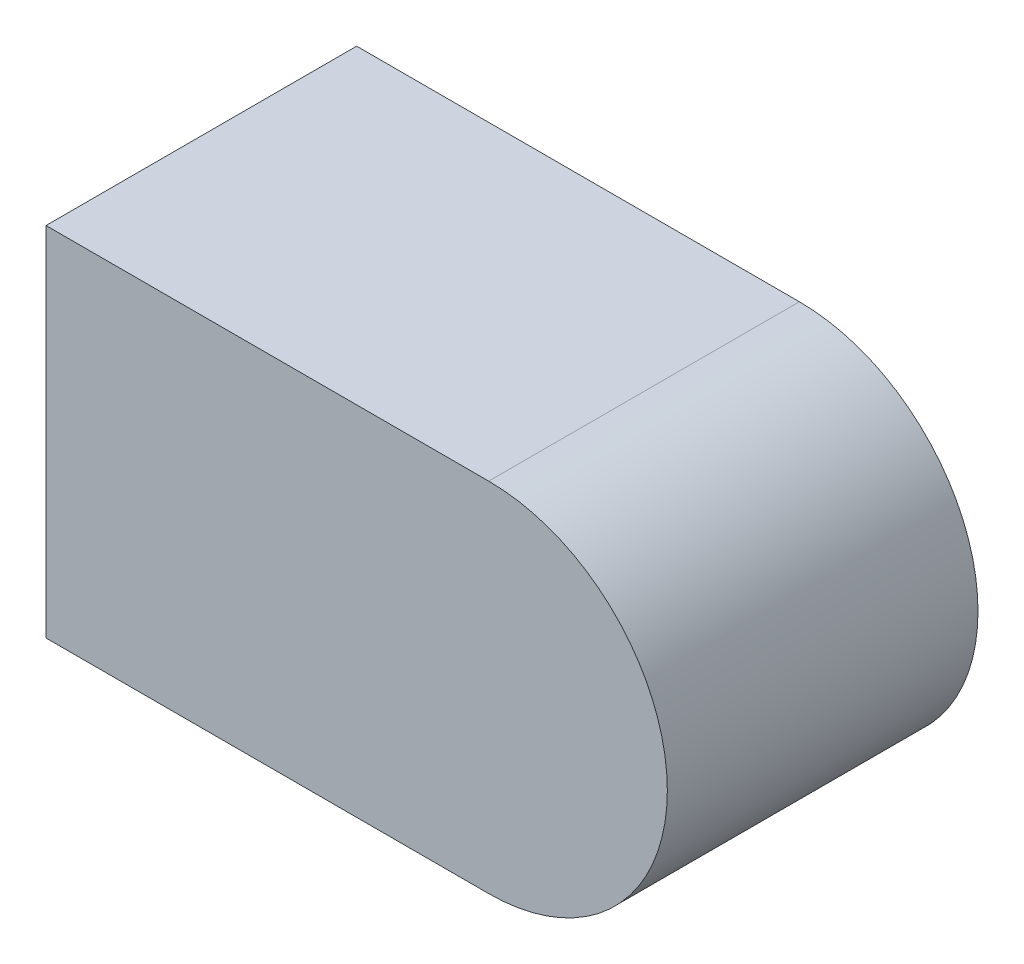
ISO-10303-21;
HEADER;
FILE_DESCRIPTION(('STEP AP214'),'2;1');
FILE_NAME('part.step','',(''),(''),'','','');
FILE_SCHEMA(('AUTOMOTIVE_DESIGN { 1 0 10303 214 1 1 1 1 }'));
ENDSEC;
DATA;
#1=APPLICATION_CONTEXT('core data for automotive mechanical design processes');
#2=APPLICATION_PROTOCOL_DEFINITION('international standard','automotive_design',2000,#1);
#3=PRODUCT_CONTEXT('',#1,'mechanical');
#4=PRODUCT('Part','Part','',(#3));
#5=PRODUCT_RELATED_PRODUCT_CATEGORY('part','',(#4));
#6=PRODUCT_DEFINITION_FORMATION('','',#4);
#7=PRODUCT_DEFINITION_CONTEXT('part definition',#1,'design');
#8=PRODUCT_DEFINITION('design','',#6,#7);
#9=PRODUCT_DEFINITION_SHAPE('','',#8);
#10=(LENGTH_UNIT() NAMED_UNIT(*) SI_UNIT(.MILLI.,.METRE.));
#11=(NAMED_UNIT(*) PLANE_ANGLE_UNIT() SI_UNIT($,.RADIAN.));
#12=(NAMED_UNIT(*) SI_UNIT($,.STERADIAN.) SOLID_ANGLE_UNIT());
#13=UNCERTAINTY_MEASURE_WITH_UNIT(LENGTH_MEASURE(1.E-05),#10,'distance_accuracy_value','');
#14=(GEOMETRIC_REPRESENTATION_CONTEXT(3) GLOBAL_UNCERTAINTY_ASSIGNED_CONTEXT((#13)) GLOBAL_UNIT_ASSIGNED_CONTEXT((#10,
#11,#12)) REPRESENTATION_CONTEXT('',''));
#15=CARTESIAN_POINT('',(0.,0.,0.));
#16=DIRECTION('',(0.,0.,1.));
#17=DIRECTION('',(1.,0.,0.));
#18=AXIS2_PLACEMENT_3D('',#15,#16,#17);
#19=CARTESIAN_POINT('',(-2.8335240809167,1.75,0.2));
#20=DIRECTION('',(0.,0.,1.));
#21=DIRECTION('',(1.,0.,0.));
#22=AXIS2_PLACEMENT_3D('',#19,#20,#21);
#23=PLANE('',#22);
#24=DIRECTION('',(-1.,0.,0.));
#25=VECTOR('',#24,1.);
#26=CARTESIAN_POINT('',(-2.715,1.865,0.2));
#27=LINE('',#26,#25);
#28=CARTESIAN_POINT('',(-2.715,1.865,0.2));
#29=VERTEX_POINT('',#28);
#30=CARTESIAN_POINT('',(-3.,1.865,0.2));
#31=VERTEX_POINT('',#30);
#32=EDGE_CURVE('E11',#29,#31,#27,.T.);
#33=ORIENTED_EDGE('',*,*,#32,.T.);
#34=DIRECTION('',(0.,-1.,0.));
#35=VECTOR('',#34,1.);
#36=CARTESIAN_POINT('',(-3.,2.375,0.2));
#37=LINE('',#36,#35);
#38=CARTESIAN_POINT('',(-3.,1.635,0.2));
#39=VERTEX_POINT('',#38);
#40=EDGE_CURVE('E24',#31,#39,#37,.T.);
#41=ORIENTED_EDGE('',*,*,#40,.T.);
#42=DIRECTION('',(1.,0.,0.));
#43=VECTOR('',#42,1.);
#44=CARTESIAN_POINT('',(-3.,1.635,0.2));
#45=LINE('',#44,#43);
#46=CARTESIAN_POINT('',(-2.715,1.635,0.2));
#47=VERTEX_POINT('',#46);
#48=EDGE_CURVE('E88',#39,#47,#45,.T.);
#49=ORIENTED_EDGE('',*,*,#48,.T.);
#50=CARTESIAN_POINT('',(-2.715,1.75,0.2));
#51=DIRECTION('',(0.,0.,1.));
#52=DIRECTION('',(0.,-1.,0.));
#53=AXIS2_PLACEMENT_3D('',#50,#51,#52);
#54=CIRCLE('',#53,0.115);
#55=EDGE_CURVE('E70',#47,#29,#54,.T.);
#56=ORIENTED_EDGE('',*,*,#55,.T.);
#57=EDGE_LOOP('',(#33,#41,#49,#56));
#58=FACE_BOUND('',#57,.T.);
#59=ADVANCED_FACE('F17',(#58),#23,.T.);
#60=CARTESIAN_POINT('',(-3.,3.,0.));
#61=DIRECTION('',(-1.,0.,0.));
#62=DIRECTION('',(0.,-1.,0.));
#63=AXIS2_PLACEMENT_3D('',#60,#61,#62);
#64=PLANE('',#63);
#65=DIRECTION('',(0.,0.,-1.));
#66=VECTOR('',#65,1.);
#67=CARTESIAN_POINT('',(-3.,1.635,0.));
#68=LINE('',#67,#66);
#69=CARTESIAN_POINT('',(-3.,1.635,0.));
#70=VERTEX_POINT('',#69);
#71=EDGE_CURVE('E76',#39,#70,#68,.T.);
#72=ORIENTED_EDGE('',*,*,#71,.F.);
#73=ORIENTED_EDGE('',*,*,#40,.F.);
#74=DIRECTION('',(0.,0.,1.));
#75=VECTOR('',#74,1.);
#76=CARTESIAN_POINT('',(-3.,1.865,0.));
#77=LINE('',#76,#75);
#78=CARTESIAN_POINT('',(-3.,1.865,0.));
#79=VERTEX_POINT('',#78);
#80=EDGE_CURVE('E84',#79,#31,#77,.T.);
#81=ORIENTED_EDGE('',*,*,#80,.F.);
#82=DIRECTION('',(0.,-1.,0.));
#83=VECTOR('',#82,1.);
#84=CARTESIAN_POINT('',(-3.,1.865,0.));
#85=LINE('',#84,#83);
#86=EDGE_CURVE('E82',#79,#70,#85,.T.);
#87=ORIENTED_EDGE('',*,*,#86,.T.);
#88=EDGE_LOOP('',(#72,#73,#81,#87));
#89=FACE_BOUND('',#88,.T.);
#90=ADVANCED_FACE('F90',(#89),#64,.T.);
#91=CARTESIAN_POINT('',(-2.715,1.865,0.));
#92=DIRECTION('',(0.,1.,0.));
#93=DIRECTION('',(-1.,0.,0.));
#94=AXIS2_PLACEMENT_3D('',#91,#92,#93);
#95=PLANE('',#94);
#96=DIRECTION('',(-1.,0.,0.));
#97=VECTOR('',#96,1.);
#98=CARTESIAN_POINT('',(-2.715,1.865,0.));
#99=LINE('',#98,#97);
#100=CARTESIAN_POINT('',(-2.715,1.865,0.));
#101=VERTEX_POINT('',#100);
#102=EDGE_CURVE('E61',#101,#79,#99,.T.);
#103=ORIENTED_EDGE('',*,*,#102,.T.);
#104=ORIENTED_EDGE('',*,*,#80,.T.);
#105=ORIENTED_EDGE('',*,*,#32,.F.);
#106=DIRECTION('',(0.,0.,1.));
#107=VECTOR('',#106,1.);
#108=CARTESIAN_POINT('',(-2.715,1.865,0.));
#109=LINE('',#108,#107);
#110=EDGE_CURVE('E64',#101,#29,#109,.T.);
#111=ORIENTED_EDGE('',*,*,#110,.F.);
#112=EDGE_LOOP('',(#103,#104,#105,#111));
#113=FACE_BOUND('',#112,.T.);
#114=ADVANCED_FACE('F91',(#113),#95,.T.);
#115=CARTESIAN_POINT('',(-2.715,1.75,0.));
#116=DIRECTION('',(0.,0.,1.));
#117=DIRECTION('',(0.,-1.,0.));
#118=AXIS2_PLACEMENT_3D('',#115,#116,#117);
#119=CYLINDRICAL_SURFACE('',#118,0.115);
#120=CARTESIAN_POINT('',(-2.715,1.75,0.));
#121=DIRECTION('',(0.,0.,1.));
#122=DIRECTION('',(0.,-1.,0.));
#123=AXIS2_PLACEMENT_3D('',#120,#121,#122);
#124=CIRCLE('',#123,0.115);
#125=CARTESIAN_POINT('',(-2.715,1.635,0.));
#126=VERTEX_POINT('',#125);
#127=EDGE_CURVE('E54',#126,#101,#124,.T.);
#128=ORIENTED_EDGE('',*,*,#127,.T.);
#129=ORIENTED_EDGE('',*,*,#110,.T.);
#130=ORIENTED_EDGE('',*,*,#55,.F.);
#131=DIRECTION('',(0.,0.,1.));
#132=VECTOR('',#131,1.);
#133=CARTESIAN_POINT('',(-2.715,1.635,0.));
#134=LINE('',#133,#132);
#135=EDGE_CURVE('E65',#126,#47,#134,.T.);
#136=ORIENTED_EDGE('',*,*,#135,.F.);
#137=EDGE_LOOP('',(#128,#129,#130,#136));
#138=FACE_BOUND('',#137,.T.);
#139=ADVANCED_FACE('F69',(#138),#119,.T.);
#140=CARTESIAN_POINT('',(-3.,1.635,0.));
#141=DIRECTION('',(0.,-1.,0.));
#142=DIRECTION('',(1.,0.,0.));
#143=AXIS2_PLACEMENT_3D('',#140,#141,#142);
#144=PLANE('',#143);
#145=DIRECTION('',(1.,0.,0.));
#146=VECTOR('',#145,1.);
#147=CARTESIAN_POINT('',(-3.,1.635,0.));
#148=LINE('',#147,#146);
#149=EDGE_CURVE('E59',#70,#126,#148,.T.);
#150=ORIENTED_EDGE('',*,*,#149,.T.);
#151=ORIENTED_EDGE('',*,*,#135,.T.);
#152=ORIENTED_EDGE('',*,*,#48,.F.);
#153=ORIENTED_EDGE('',*,*,#71,.T.);
#154=EDGE_LOOP('',(#150,#151,#152,#153));
#155=FACE_BOUND('',#154,.T.);
#156=ADVANCED_FACE('F74',(#155),#144,.T.);
#157=CARTESIAN_POINT('',(-2.8335265642716,1.75,0.));
#158=DIRECTION('',(0.,0.,1.));
#159=DIRECTION('',(1.,0.,0.));
#160=AXIS2_PLACEMENT_3D('',#157,#158,#159);
#161=PLANE('',#160);
#162=ORIENTED_EDGE('',*,*,#86,.F.);
#163=ORIENTED_EDGE('',*,*,#102,.F.);
#164=ORIENTED_EDGE('',*,*,#127,.F.);
#165=ORIENTED_EDGE('',*,*,#149,.F.);
#166=EDGE_LOOP('',(#162,#163,#164,#165));
#167=FACE_BOUND('',#166,.T.);
#168=ADVANCED_FACE('F57',(#167),#161,.F.);
#169=CLOSED_SHELL('',(#59,#90,#114,#139,#156,#168));
#170=MANIFOLD_SOLID_BREP('B1',#169);
#171=ADVANCED_BREP_SHAPE_REPRESENTATION('',(#18,#170),#14);
#172=SHAPE_DEFINITION_REPRESENTATION(#9,#171);
ENDSEC;
END-ISO-10303-21;
